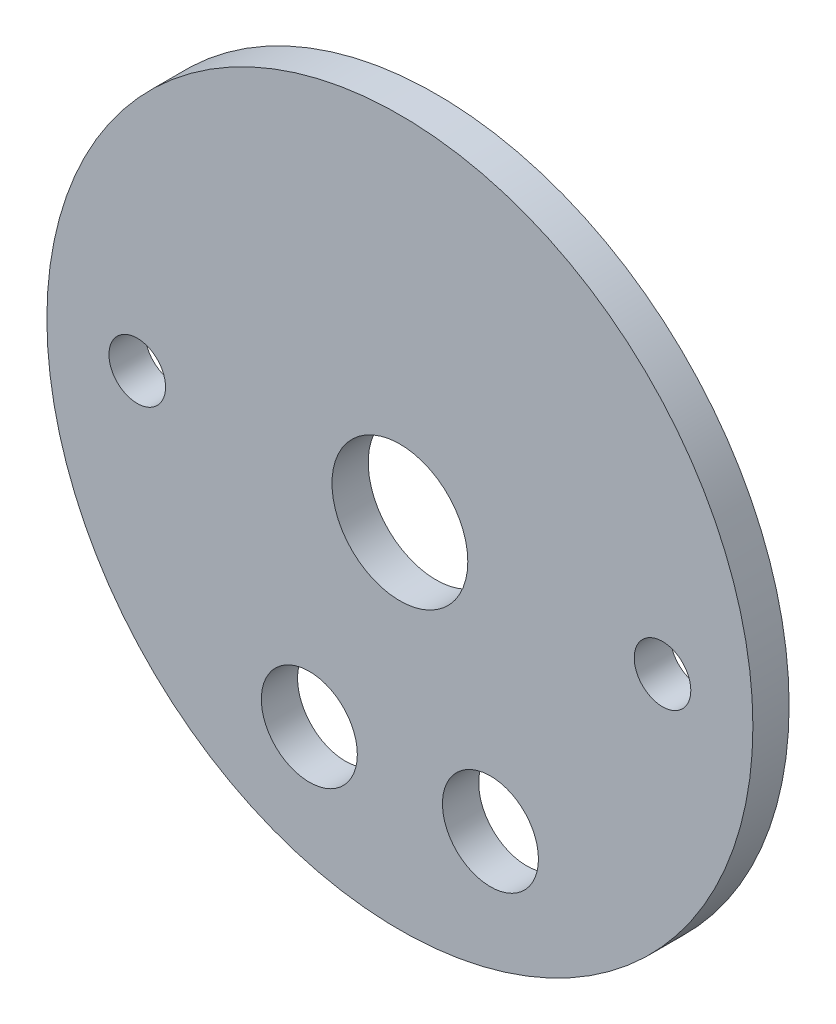
ISO-10303-21;
HEADER;
FILE_DESCRIPTION(('STEP AP214'),'2;1');
FILE_NAME('part.step','',(''),(''),'','','');
FILE_SCHEMA(('AUTOMOTIVE_DESIGN { 1 0 10303 214 1 1 1 1 }'));
ENDSEC;
DATA;
#1=APPLICATION_CONTEXT('core data for automotive mechanical design processes');
#2=APPLICATION_PROTOCOL_DEFINITION('international standard','automotive_design',2000,#1);
#3=PRODUCT_CONTEXT('',#1,'mechanical');
#4=PRODUCT('Part','Part','',(#3));
#5=PRODUCT_RELATED_PRODUCT_CATEGORY('part','',(#4));
#6=PRODUCT_DEFINITION_FORMATION('','',#4);
#7=PRODUCT_DEFINITION_CONTEXT('part definition',#1,'design');
#8=PRODUCT_DEFINITION('design','',#6,#7);
#9=PRODUCT_DEFINITION_SHAPE('','',#8);
#10=(LENGTH_UNIT() NAMED_UNIT(*) SI_UNIT(.MILLI.,.METRE.));
#11=(NAMED_UNIT(*) PLANE_ANGLE_UNIT() SI_UNIT($,.RADIAN.));
#12=(NAMED_UNIT(*) SI_UNIT($,.STERADIAN.) SOLID_ANGLE_UNIT());
#13=UNCERTAINTY_MEASURE_WITH_UNIT(LENGTH_MEASURE(1.E-05),#10,'distance_accuracy_value','');
#14=(GEOMETRIC_REPRESENTATION_CONTEXT(3) GLOBAL_UNCERTAINTY_ASSIGNED_CONTEXT((#13)) GLOBAL_UNIT_ASSIGNED_CONTEXT((#10,
#11,#12)) REPRESENTATION_CONTEXT('',''));
#15=CARTESIAN_POINT('',(0.,0.,0.));
#16=DIRECTION('',(0.,0.,1.));
#17=DIRECTION('',(1.,0.,0.));
#18=AXIS2_PLACEMENT_3D('',#15,#16,#17);
#19=CARTESIAN_POINT('',(-12.7,-31.1667936271924,0.));
#20=DIRECTION('',(0.,0.,1.));
#21=DIRECTION('',(1.,0.,0.));
#22=AXIS2_PLACEMENT_3D('',#19,#20,#21);
#23=CYLINDRICAL_SURFACE('',#22,6.731);
#24=CARTESIAN_POINT('',(-12.7,-31.1667936271924,0.));
#25=DIRECTION('',(0.,0.,1.));
#26=DIRECTION('',(1.,0.,0.));
#27=AXIS2_PLACEMENT_3D('',#24,#25,#26);
#28=CIRCLE('',#27,6.731);
#29=CARTESIAN_POINT('',(-5.969,-31.1667936271924,0.));
#30=VERTEX_POINT('',#29);
#31=EDGE_CURVE('E45',#30,#30,#28,.T.);
#32=ORIENTED_EDGE('',*,*,#31,.F.);
#33=EDGE_LOOP('',(#32));
#34=FACE_BOUND('',#33,.T.);
#35=CARTESIAN_POINT('',(-12.7,-31.1667936271924,5.08));
#36=DIRECTION('',(0.,0.,1.));
#37=DIRECTION('',(1.,0.,0.));
#38=AXIS2_PLACEMENT_3D('',#35,#36,#37);
#39=CIRCLE('',#38,6.731);
#40=CARTESIAN_POINT('',(-5.969,-31.1667936271924,5.08));
#41=VERTEX_POINT('',#40);
#42=EDGE_CURVE('E59',#41,#41,#39,.F.);
#43=ORIENTED_EDGE('',*,*,#42,.F.);
#44=EDGE_LOOP('',(#43));
#45=FACE_BOUND('',#44,.T.);
#46=ADVANCED_FACE('F32',(#34,#45),#23,.F.);
#47=CARTESIAN_POINT('',(0.,0.,0.));
#48=DIRECTION('',(0.,0.,1.));
#49=DIRECTION('',(1.,0.,0.));
#50=AXIS2_PLACEMENT_3D('',#47,#48,#49);
#51=CYLINDRICAL_SURFACE('',#50,9.525);
#52=CARTESIAN_POINT('',(0.,0.,0.));
#53=DIRECTION('',(0.,0.,1.));
#54=DIRECTION('',(1.,0.,0.));
#55=AXIS2_PLACEMENT_3D('',#52,#53,#54);
#56=CIRCLE('',#55,9.525);
#57=CARTESIAN_POINT('',(9.525,0.,0.));
#58=VERTEX_POINT('',#57);
#59=EDGE_CURVE('E56',#58,#58,#56,.T.);
#60=ORIENTED_EDGE('',*,*,#59,.F.);
#61=EDGE_LOOP('',(#60));
#62=FACE_BOUND('',#61,.T.);
#63=CARTESIAN_POINT('',(0.,0.,5.08));
#64=DIRECTION('',(0.,0.,1.));
#65=DIRECTION('',(1.,0.,0.));
#66=AXIS2_PLACEMENT_3D('',#63,#64,#65);
#67=CIRCLE('',#66,9.525);
#68=CARTESIAN_POINT('',(9.525,0.,5.08));
#69=VERTEX_POINT('',#68);
#70=EDGE_CURVE('E64',#69,#69,#67,.F.);
#71=ORIENTED_EDGE('',*,*,#70,.F.);
#72=EDGE_LOOP('',(#71));
#73=FACE_BOUND('',#72,.T.);
#74=ADVANCED_FACE('F95',(#62,#73),#51,.F.);
#75=CARTESIAN_POINT('',(36.83,0.,0.));
#76=DIRECTION('',(0.,0.,1.));
#77=DIRECTION('',(1.,0.,0.));
#78=AXIS2_PLACEMENT_3D('',#75,#76,#77);
#79=CYLINDRICAL_SURFACE('',#78,3.96875);
#80=CARTESIAN_POINT('',(36.83,0.,0.));
#81=DIRECTION('',(0.,0.,1.));
#82=DIRECTION('',(1.,0.,0.));
#83=AXIS2_PLACEMENT_3D('',#80,#81,#82);
#84=CIRCLE('',#83,3.96875);
#85=CARTESIAN_POINT('',(40.79875,0.,0.));
#86=VERTEX_POINT('',#85);
#87=EDGE_CURVE('E53',#86,#86,#84,.T.);
#88=ORIENTED_EDGE('',*,*,#87,.F.);
#89=EDGE_LOOP('',(#88));
#90=FACE_BOUND('',#89,.T.);
#91=CARTESIAN_POINT('',(36.83,0.,5.08));
#92=DIRECTION('',(0.,0.,1.));
#93=DIRECTION('',(1.,0.,0.));
#94=AXIS2_PLACEMENT_3D('',#91,#92,#93);
#95=CIRCLE('',#94,3.96875);
#96=CARTESIAN_POINT('',(40.79875,0.,5.08));
#97=VERTEX_POINT('',#96);
#98=EDGE_CURVE('E67',#97,#97,#95,.F.);
#99=ORIENTED_EDGE('',*,*,#98,.F.);
#100=EDGE_LOOP('',(#99));
#101=FACE_BOUND('',#100,.T.);
#102=ADVANCED_FACE('F89',(#90,#101),#79,.F.);
#103=CARTESIAN_POINT('',(-36.83,0.,0.));
#104=DIRECTION('',(0.,0.,1.));
#105=DIRECTION('',(1.,0.,0.));
#106=AXIS2_PLACEMENT_3D('',#103,#104,#105);
#107=CYLINDRICAL_SURFACE('',#106,3.96875);
#108=CARTESIAN_POINT('',(-36.83,0.,0.));
#109=DIRECTION('',(0.,0.,1.));
#110=DIRECTION('',(1.,0.,0.));
#111=AXIS2_PLACEMENT_3D('',#108,#109,#110);
#112=CIRCLE('',#111,3.96875);
#113=CARTESIAN_POINT('',(-32.86125,0.,0.));
#114=VERTEX_POINT('',#113);
#115=EDGE_CURVE('E50',#114,#114,#112,.T.);
#116=ORIENTED_EDGE('',*,*,#115,.F.);
#117=EDGE_LOOP('',(#116));
#118=FACE_BOUND('',#117,.T.);
#119=CARTESIAN_POINT('',(-36.83,0.,5.08));
#120=DIRECTION('',(0.,0.,1.));
#121=DIRECTION('',(1.,0.,0.));
#122=AXIS2_PLACEMENT_3D('',#119,#120,#121);
#123=CIRCLE('',#122,3.96875);
#124=CARTESIAN_POINT('',(-32.86125,0.,5.08));
#125=VERTEX_POINT('',#124);
#126=EDGE_CURVE('E70',#125,#125,#123,.F.);
#127=ORIENTED_EDGE('',*,*,#126,.F.);
#128=EDGE_LOOP('',(#127));
#129=FACE_BOUND('',#128,.T.);
#130=ADVANCED_FACE('F81',(#118,#129),#107,.F.);
#131=CARTESIAN_POINT('',(12.7,-31.1667936271924,0.));
#132=DIRECTION('',(0.,0.,1.));
#133=DIRECTION('',(1.,0.,0.));
#134=AXIS2_PLACEMENT_3D('',#131,#132,#133);
#135=CYLINDRICAL_SURFACE('',#134,6.731);
#136=CARTESIAN_POINT('',(12.7,-31.1667936271924,0.));
#137=DIRECTION('',(0.,0.,1.));
#138=DIRECTION('',(1.,0.,0.));
#139=AXIS2_PLACEMENT_3D('',#136,#137,#138);
#140=CIRCLE('',#139,6.731);
#141=CARTESIAN_POINT('',(19.431,-31.1667936271924,0.));
#142=VERTEX_POINT('',#141);
#143=EDGE_CURVE('E49',#142,#142,#140,.T.);
#144=ORIENTED_EDGE('',*,*,#143,.F.);
#145=EDGE_LOOP('',(#144));
#146=FACE_BOUND('',#145,.T.);
#147=CARTESIAN_POINT('',(12.7,-31.1667936271924,5.08));
#148=DIRECTION('',(0.,0.,1.));
#149=DIRECTION('',(1.,0.,0.));
#150=AXIS2_PLACEMENT_3D('',#147,#148,#149);
#151=CIRCLE('',#150,6.731);
#152=CARTESIAN_POINT('',(19.431,-31.1667936271924,5.08));
#153=VERTEX_POINT('',#152);
#154=EDGE_CURVE('E36',#153,#153,#151,.F.);
#155=ORIENTED_EDGE('',*,*,#154,.F.);
#156=EDGE_LOOP('',(#155));
#157=FACE_BOUND('',#156,.T.);
#158=ADVANCED_FACE('F79',(#146,#157),#135,.F.);
#159=CARTESIAN_POINT('',(0.,0.,5.08));
#160=DIRECTION('',(0.,0.,-1.));
#161=DIRECTION('',(-1.,0.,0.));
#162=AXIS2_PLACEMENT_3D('',#159,#160,#161);
#163=CYLINDRICAL_SURFACE('',#162,49.5046);
#164=CARTESIAN_POINT('',(0.,0.,5.08));
#165=DIRECTION('',(0.,0.,1.));
#166=DIRECTION('',(1.,0.,0.));
#167=AXIS2_PLACEMENT_3D('',#164,#165,#166);
#168=CIRCLE('',#167,49.5046);
#169=CARTESIAN_POINT('',(49.5046,0.,5.08));
#170=VERTEX_POINT('',#169);
#171=EDGE_CURVE('E10',#170,#170,#168,.T.);
#172=ORIENTED_EDGE('',*,*,#171,.F.);
#173=EDGE_LOOP('',(#172));
#174=FACE_BOUND('',#173,.T.);
#175=CARTESIAN_POINT('',(0.,0.,0.));
#176=DIRECTION('',(0.,0.,1.));
#177=DIRECTION('',(1.,0.,0.));
#178=AXIS2_PLACEMENT_3D('',#175,#176,#177);
#179=CIRCLE('',#178,49.5046);
#180=CARTESIAN_POINT('',(49.5046,0.,0.));
#181=VERTEX_POINT('',#180);
#182=EDGE_CURVE('E40',#181,#181,#179,.T.);
#183=ORIENTED_EDGE('',*,*,#182,.T.);
#184=EDGE_LOOP('',(#183));
#185=FACE_BOUND('',#184,.T.);
#186=ADVANCED_FACE('F34',(#174,#185),#163,.T.);
#187=CARTESIAN_POINT('',(0.,0.,5.08));
#188=DIRECTION('',(0.,0.,1.));
#189=DIRECTION('',(1.,0.,0.));
#190=AXIS2_PLACEMENT_3D('',#187,#188,#189);
#191=PLANE('',#190);
#192=ORIENTED_EDGE('',*,*,#171,.T.);
#193=EDGE_LOOP('',(#192));
#194=FACE_BOUND('',#193,.T.);
#195=ORIENTED_EDGE('',*,*,#42,.T.);
#196=EDGE_LOOP('',(#195));
#197=FACE_BOUND('',#196,.T.);
#198=ORIENTED_EDGE('',*,*,#70,.T.);
#199=EDGE_LOOP('',(#198));
#200=FACE_BOUND('',#199,.T.);
#201=ORIENTED_EDGE('',*,*,#98,.T.);
#202=EDGE_LOOP('',(#201));
#203=FACE_BOUND('',#202,.T.);
#204=ORIENTED_EDGE('',*,*,#126,.T.);
#205=EDGE_LOOP('',(#204));
#206=FACE_BOUND('',#205,.T.);
#207=ORIENTED_EDGE('',*,*,#154,.T.);
#208=EDGE_LOOP('',(#207));
#209=FACE_BOUND('',#208,.T.);
#210=ADVANCED_FACE('F77',(#194,#197,#200,#203,#206,#209),#191,.T.);
#211=CARTESIAN_POINT('',(0.,0.,0.));
#212=DIRECTION('',(0.,0.,1.));
#213=DIRECTION('',(1.,0.,0.));
#214=AXIS2_PLACEMENT_3D('',#211,#212,#213);
#215=PLANE('',#214);
#216=ORIENTED_EDGE('',*,*,#143,.T.);
#217=EDGE_LOOP('',(#216));
#218=FACE_BOUND('',#217,.T.);
#219=ORIENTED_EDGE('',*,*,#115,.T.);
#220=EDGE_LOOP('',(#219));
#221=FACE_BOUND('',#220,.T.);
#222=ORIENTED_EDGE('',*,*,#87,.T.);
#223=EDGE_LOOP('',(#222));
#224=FACE_BOUND('',#223,.T.);
#225=ORIENTED_EDGE('',*,*,#59,.T.);
#226=EDGE_LOOP('',(#225));
#227=FACE_BOUND('',#226,.T.);
#228=ORIENTED_EDGE('',*,*,#31,.T.);
#229=EDGE_LOOP('',(#228));
#230=FACE_BOUND('',#229,.T.);
#231=ORIENTED_EDGE('',*,*,#182,.F.);
#232=EDGE_LOOP('',(#231));
#233=FACE_BOUND('',#232,.T.);
#234=ADVANCED_FACE('F106',(#218,#221,#224,#227,#230,#233),#215,.F.);
#235=CLOSED_SHELL('',(#46,#74,#102,#130,#158,#186,#210,#234));
#236=MANIFOLD_SOLID_BREP('B2',#235);
#237=ADVANCED_BREP_SHAPE_REPRESENTATION('',(#18,#236),#14);
#238=SHAPE_DEFINITION_REPRESENTATION(#9,#237);
ENDSEC;
END-ISO-10303-21;
